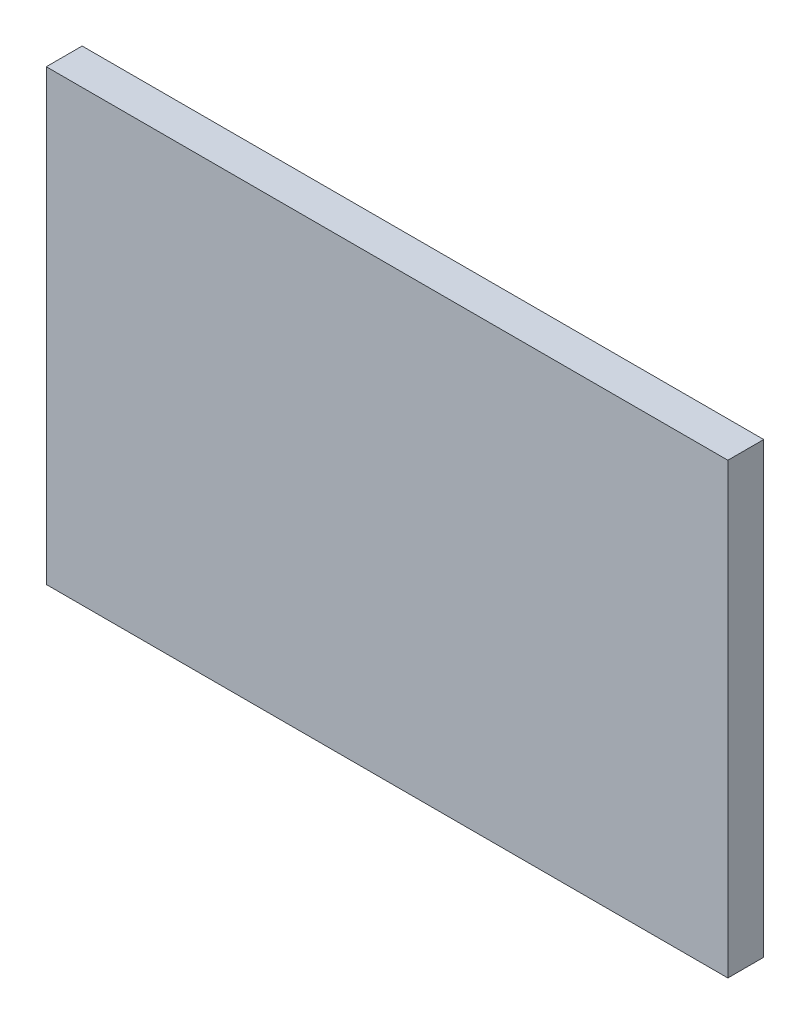
ISO-10303-21;
HEADER;
FILE_DESCRIPTION(('STEP AP214'),'2;1');
FILE_NAME('part.step','',(''),(''),'','','');
FILE_SCHEMA(('AUTOMOTIVE_DESIGN { 1 0 10303 214 1 1 1 1 }'));
ENDSEC;
DATA;
#1=APPLICATION_CONTEXT('core data for automotive mechanical design processes');
#2=APPLICATION_PROTOCOL_DEFINITION('international standard','automotive_design',2000,#1);
#3=PRODUCT_CONTEXT('',#1,'mechanical');
#4=PRODUCT('Part','Part','',(#3));
#5=PRODUCT_RELATED_PRODUCT_CATEGORY('part','',(#4));
#6=PRODUCT_DEFINITION_FORMATION('','',#4);
#7=PRODUCT_DEFINITION_CONTEXT('part definition',#1,'design');
#8=PRODUCT_DEFINITION('design','',#6,#7);
#9=PRODUCT_DEFINITION_SHAPE('','',#8);
#10=(LENGTH_UNIT() NAMED_UNIT(*) SI_UNIT(.MILLI.,.METRE.));
#11=(NAMED_UNIT(*) PLANE_ANGLE_UNIT() SI_UNIT($,.RADIAN.));
#12=(NAMED_UNIT(*) SI_UNIT($,.STERADIAN.) SOLID_ANGLE_UNIT());
#13=UNCERTAINTY_MEASURE_WITH_UNIT(LENGTH_MEASURE(1.E-05),#10,'distance_accuracy_value','');
#14=(GEOMETRIC_REPRESENTATION_CONTEXT(3) GLOBAL_UNCERTAINTY_ASSIGNED_CONTEXT((#13)) GLOBAL_UNIT_ASSIGNED_CONTEXT((#10,
#11,#12)) REPRESENTATION_CONTEXT('',''));
#15=CARTESIAN_POINT('',(0.,0.,0.));
#16=DIRECTION('',(0.,0.,1.));
#17=DIRECTION('',(1.,0.,0.));
#18=AXIS2_PLACEMENT_3D('',#15,#16,#17);
#19=CARTESIAN_POINT('',(-131.588044069841,75.8064516129032,20.));
#20=DIRECTION('',(1.,0.,0.));
#21=DIRECTION('',(0.,1.,0.));
#22=AXIS2_PLACEMENT_3D('',#19,#20,#21);
#23=PLANE('',#22);
#24=DIRECTION('',(0.,-1.,0.));
#25=VECTOR('',#24,1.);
#26=CARTESIAN_POINT('',(-131.588044069841,75.8064516129032,0.));
#27=LINE('',#26,#25);
#28=CARTESIAN_POINT('',(-131.588044069841,75.8064516129032,0.));
#29=VERTEX_POINT('',#28);
#30=CARTESIAN_POINT('',(-131.588044069841,-174.193548387097,0.));
#31=VERTEX_POINT('',#30);
#32=EDGE_CURVE('E99',#29,#31,#27,.T.);
#33=ORIENTED_EDGE('',*,*,#32,.T.);
#34=DIRECTION('',(0.,0.,-1.));
#35=VECTOR('',#34,1.);
#36=CARTESIAN_POINT('',(-131.588044069841,-174.193548387097,20.));
#37=LINE('',#36,#35);
#38=CARTESIAN_POINT('',(-131.588044069841,-174.193548387097,20.));
#39=VERTEX_POINT('',#38);
#40=EDGE_CURVE('E11',#39,#31,#37,.T.);
#41=ORIENTED_EDGE('',*,*,#40,.F.);
#42=DIRECTION('',(0.,-1.,0.));
#43=VECTOR('',#42,1.);
#44=CARTESIAN_POINT('',(-131.588044069841,75.8064516129032,20.));
#45=LINE('',#44,#43);
#46=CARTESIAN_POINT('',(-131.588044069841,75.8064516129032,20.));
#47=VERTEX_POINT('',#46);
#48=EDGE_CURVE('E87',#47,#39,#45,.T.);
#49=ORIENTED_EDGE('',*,*,#48,.F.);
#50=DIRECTION('',(0.,0.,-1.));
#51=VECTOR('',#50,1.);
#52=CARTESIAN_POINT('',(-131.588044069841,75.8064516129032,20.));
#53=LINE('',#52,#51);
#54=EDGE_CURVE('E95',#47,#29,#53,.T.);
#55=ORIENTED_EDGE('',*,*,#54,.T.);
#56=EDGE_LOOP('',(#33,#41,#49,#55));
#57=FACE_BOUND('',#56,.T.);
#58=ADVANCED_FACE('F36',(#57),#23,.F.);
#59=CARTESIAN_POINT('',(-131.588044069841,-174.193548387097,20.));
#60=DIRECTION('',(0.,1.,0.));
#61=DIRECTION('',(0.,0.,1.));
#62=AXIS2_PLACEMENT_3D('',#59,#60,#61);
#63=PLANE('',#62);
#64=DIRECTION('',(1.,0.,0.));
#65=VECTOR('',#64,1.);
#66=CARTESIAN_POINT('',(-131.588044069841,-174.193548387097,0.));
#67=LINE('',#66,#65);
#68=CARTESIAN_POINT('',(248.411955930159,-174.193548387097,0.));
#69=VERTEX_POINT('',#68);
#70=EDGE_CURVE('E91',#31,#69,#67,.T.);
#71=ORIENTED_EDGE('',*,*,#70,.T.);
#72=DIRECTION('',(0.,0.,-1.));
#73=VECTOR('',#72,1.);
#74=CARTESIAN_POINT('',(248.411955930159,-174.193548387097,20.));
#75=LINE('',#74,#73);
#76=CARTESIAN_POINT('',(248.411955930159,-174.193548387097,20.));
#77=VERTEX_POINT('',#76);
#78=EDGE_CURVE('E44',#77,#69,#75,.T.);
#79=ORIENTED_EDGE('',*,*,#78,.F.);
#80=DIRECTION('',(1.,0.,0.));
#81=VECTOR('',#80,1.);
#82=CARTESIAN_POINT('',(-131.588044069841,-174.193548387097,20.));
#83=LINE('',#82,#81);
#84=EDGE_CURVE('E82',#39,#77,#83,.T.);
#85=ORIENTED_EDGE('',*,*,#84,.F.);
#86=ORIENTED_EDGE('',*,*,#40,.T.);
#87=EDGE_LOOP('',(#71,#79,#85,#86));
#88=FACE_BOUND('',#87,.T.);
#89=ADVANCED_FACE('F90',(#88),#63,.F.);
#90=CARTESIAN_POINT('',(248.411955930159,75.8064516129032,20.));
#91=DIRECTION('',(-1.,0.,0.));
#92=DIRECTION('',(0.,-1.,0.));
#93=AXIS2_PLACEMENT_3D('',#90,#91,#92);
#94=PLANE('',#93);
#95=DIRECTION('',(0.,1.,0.));
#96=VECTOR('',#95,1.);
#97=CARTESIAN_POINT('',(248.411955930159,75.8064516129032,0.));
#98=LINE('',#97,#96);
#99=CARTESIAN_POINT('',(248.411955930159,75.8064516129032,0.));
#100=VERTEX_POINT('',#99);
#101=EDGE_CURVE('E69',#69,#100,#98,.T.);
#102=ORIENTED_EDGE('',*,*,#101,.T.);
#103=DIRECTION('',(0.,0.,-1.));
#104=VECTOR('',#103,1.);
#105=CARTESIAN_POINT('',(248.411955930159,75.8064516129032,20.));
#106=LINE('',#105,#104);
#107=CARTESIAN_POINT('',(248.411955930159,75.8064516129032,20.));
#108=VERTEX_POINT('',#107);
#109=EDGE_CURVE('E92',#108,#100,#106,.T.);
#110=ORIENTED_EDGE('',*,*,#109,.F.);
#111=DIRECTION('',(0.,1.,0.));
#112=VECTOR('',#111,1.);
#113=CARTESIAN_POINT('',(248.411955930159,75.8064516129032,20.));
#114=LINE('',#113,#112);
#115=EDGE_CURVE('E85',#77,#108,#114,.T.);
#116=ORIENTED_EDGE('',*,*,#115,.F.);
#117=ORIENTED_EDGE('',*,*,#78,.T.);
#118=EDGE_LOOP('',(#102,#110,#116,#117));
#119=FACE_BOUND('',#118,.T.);
#120=ADVANCED_FACE('F93',(#119),#94,.F.);
#121=CARTESIAN_POINT('',(-131.588044069841,75.8064516129032,20.));
#122=DIRECTION('',(0.,-1.,0.));
#123=DIRECTION('',(0.,0.,-1.));
#124=AXIS2_PLACEMENT_3D('',#121,#122,#123);
#125=PLANE('',#124);
#126=DIRECTION('',(-1.,0.,0.));
#127=VECTOR('',#126,1.);
#128=CARTESIAN_POINT('',(-131.588044069841,75.8064516129032,0.));
#129=LINE('',#128,#127);
#130=EDGE_CURVE('E75',#100,#29,#129,.T.);
#131=ORIENTED_EDGE('',*,*,#130,.T.);
#132=ORIENTED_EDGE('',*,*,#54,.F.);
#133=DIRECTION('',(-1.,0.,0.));
#134=VECTOR('',#133,1.);
#135=CARTESIAN_POINT('',(-131.588044069841,75.8064516129032,20.));
#136=LINE('',#135,#134);
#137=EDGE_CURVE('E52',#108,#47,#136,.T.);
#138=ORIENTED_EDGE('',*,*,#137,.F.);
#139=ORIENTED_EDGE('',*,*,#109,.T.);
#140=EDGE_LOOP('',(#131,#132,#138,#139));
#141=FACE_BOUND('',#140,.T.);
#142=ADVANCED_FACE('F106',(#141),#125,.F.);
#143=CARTESIAN_POINT('',(0.,0.,20.));
#144=DIRECTION('',(0.,0.,1.));
#145=DIRECTION('',(1.,0.,0.));
#146=AXIS2_PLACEMENT_3D('',#143,#144,#145);
#147=PLANE('',#146);
#148=ORIENTED_EDGE('',*,*,#48,.T.);
#149=ORIENTED_EDGE('',*,*,#84,.T.);
#150=ORIENTED_EDGE('',*,*,#115,.T.);
#151=ORIENTED_EDGE('',*,*,#137,.T.);
#152=EDGE_LOOP('',(#148,#149,#150,#151));
#153=FACE_BOUND('',#152,.T.);
#154=ADVANCED_FACE('F83',(#153),#147,.T.);
#155=CARTESIAN_POINT('',(0.,0.,0.));
#156=DIRECTION('',(0.,0.,1.));
#157=DIRECTION('',(1.,0.,0.));
#158=AXIS2_PLACEMENT_3D('',#155,#156,#157);
#159=PLANE('',#158);
#160=ORIENTED_EDGE('',*,*,#32,.F.);
#161=ORIENTED_EDGE('',*,*,#130,.F.);
#162=ORIENTED_EDGE('',*,*,#101,.F.);
#163=ORIENTED_EDGE('',*,*,#70,.F.);
#164=EDGE_LOOP('',(#160,#161,#162,#163));
#165=FACE_BOUND('',#164,.T.);
#166=ADVANCED_FACE('F109',(#165),#159,.F.);
#167=CLOSED_SHELL('',(#58,#89,#120,#142,#154,#166));
#168=MANIFOLD_SOLID_BREP('B2',#167);
#169=ADVANCED_BREP_SHAPE_REPRESENTATION('',(#18,#168),#14);
#170=SHAPE_DEFINITION_REPRESENTATION(#9,#169);
ENDSEC;
END-ISO-10303-21;
